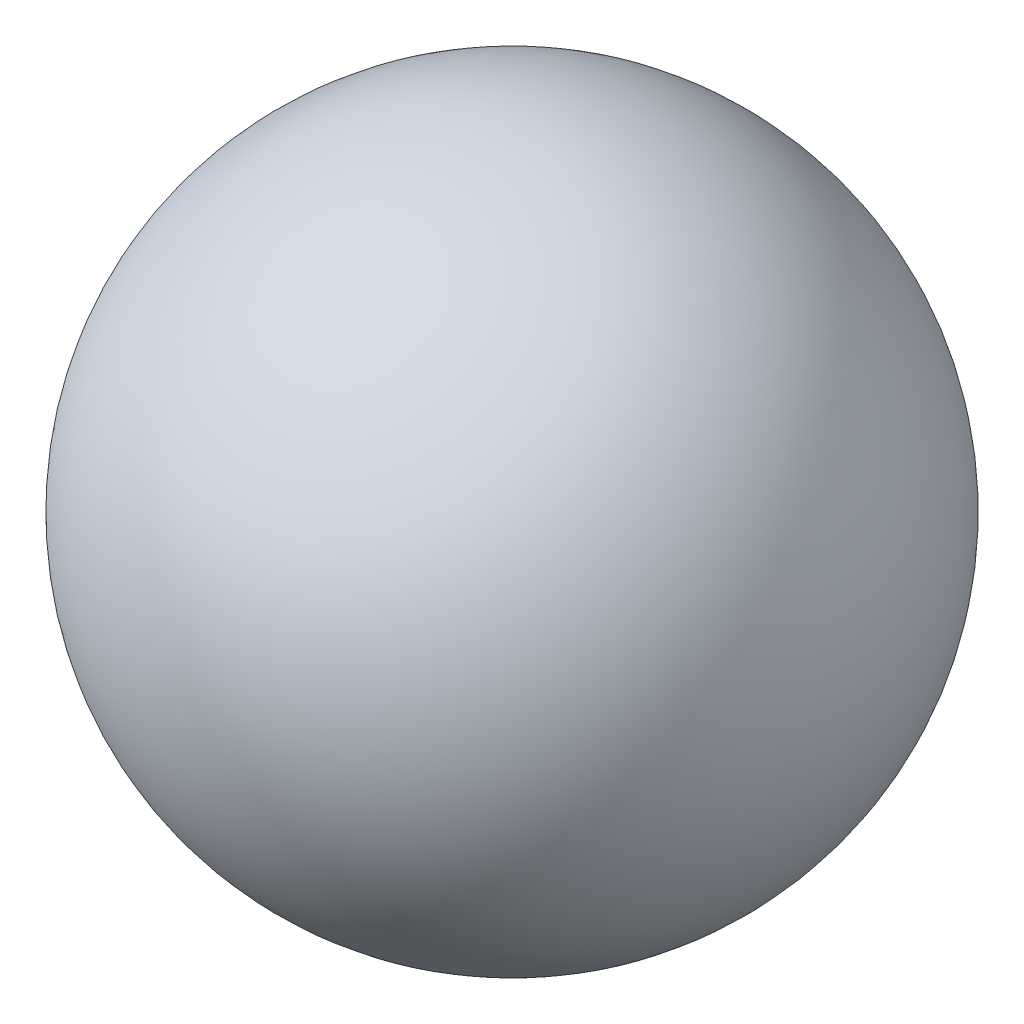
ISO-10303-21;
HEADER;
FILE_DESCRIPTION(('STEP AP214'),'2;1');
FILE_NAME('part.step','',(''),(''),'','','');
FILE_SCHEMA(('AUTOMOTIVE_DESIGN { 1 0 10303 214 1 1 1 1 }'));
ENDSEC;
DATA;
#1=APPLICATION_CONTEXT('core data for automotive mechanical design processes');
#2=APPLICATION_PROTOCOL_DEFINITION('international standard','automotive_design',2000,#1);
#3=PRODUCT_CONTEXT('',#1,'mechanical');
#4=PRODUCT('Part','Part','',(#3));
#5=PRODUCT_RELATED_PRODUCT_CATEGORY('part','',(#4));
#6=PRODUCT_DEFINITION_FORMATION('','',#4);
#7=PRODUCT_DEFINITION_CONTEXT('part definition',#1,'design');
#8=PRODUCT_DEFINITION('design','',#6,#7);
#9=PRODUCT_DEFINITION_SHAPE('','',#8);
#10=(LENGTH_UNIT() NAMED_UNIT(*) SI_UNIT(.MILLI.,.METRE.));
#11=(NAMED_UNIT(*) PLANE_ANGLE_UNIT() SI_UNIT($,.RADIAN.));
#12=(NAMED_UNIT(*) SI_UNIT($,.STERADIAN.) SOLID_ANGLE_UNIT());
#13=UNCERTAINTY_MEASURE_WITH_UNIT(LENGTH_MEASURE(1.E-05),#10,'distance_accuracy_value','');
#14=(GEOMETRIC_REPRESENTATION_CONTEXT(3) GLOBAL_UNCERTAINTY_ASSIGNED_CONTEXT((#13)) GLOBAL_UNIT_ASSIGNED_CONTEXT((#10,
#11,#12)) REPRESENTATION_CONTEXT('',''));
#15=CARTESIAN_POINT('',(0.,0.,0.));
#16=DIRECTION('',(0.,0.,1.));
#17=DIRECTION('',(1.,0.,0.));
#18=AXIS2_PLACEMENT_3D('',#15,#16,#17);
#19=CARTESIAN_POINT('',(0.,0.,0.));
#20=DIRECTION('',(0.,1.,0.));
#21=DIRECTION('',(1.,0.,0.));
#22=AXIS2_PLACEMENT_3D('',#19,#20,#21);
#23=SPHERICAL_SURFACE('',#22,25.4);
#24=CARTESIAN_POINT('',(0.,25.4,0.));
#25=VERTEX_POINT('',#24);
#26=VERTEX_LOOP('',#25);
#27=FACE_BOUND('',#26,.T.);
#28=ADVANCED_FACE('F29',(#27),#23,.T.);
#29=CLOSED_SHELL('',(#28));
#30=MANIFOLD_SOLID_BREP('B2',#29);
#31=ADVANCED_BREP_SHAPE_REPRESENTATION('',(#18,#30),#14);
#32=SHAPE_DEFINITION_REPRESENTATION(#9,#31);
ENDSEC;
END-ISO-10303-21;
